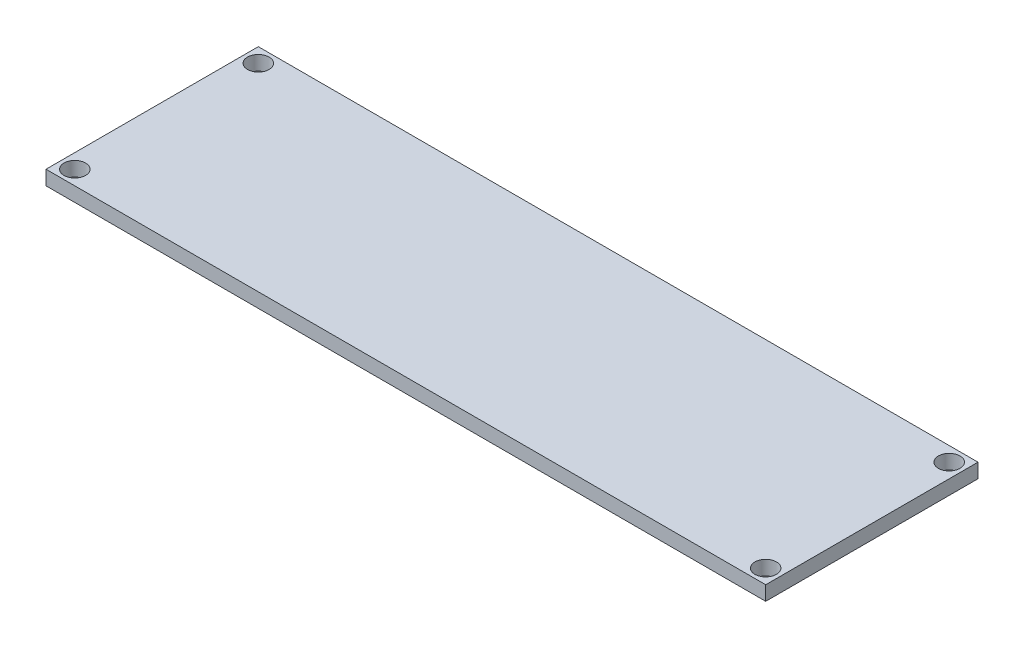
ISO-10303-21;
HEADER;
FILE_DESCRIPTION(('STEP AP214'),'2;1');
FILE_NAME('part.step','',(''),(''),'','','');
FILE_SCHEMA(('AUTOMOTIVE_DESIGN { 1 0 10303 214 1 1 1 1 }'));
ENDSEC;
DATA;
#1=APPLICATION_CONTEXT('core data for automotive mechanical design processes');
#2=APPLICATION_PROTOCOL_DEFINITION('international standard','automotive_design',2000,#1);
#3=PRODUCT_CONTEXT('',#1,'mechanical');
#4=PRODUCT('Part','Part','',(#3));
#5=PRODUCT_RELATED_PRODUCT_CATEGORY('part','',(#4));
#6=PRODUCT_DEFINITION_FORMATION('','',#4);
#7=PRODUCT_DEFINITION_CONTEXT('part definition',#1,'design');
#8=PRODUCT_DEFINITION('design','',#6,#7);
#9=PRODUCT_DEFINITION_SHAPE('','',#8);
#10=(LENGTH_UNIT() NAMED_UNIT(*) SI_UNIT(.MILLI.,.METRE.));
#11=(NAMED_UNIT(*) PLANE_ANGLE_UNIT() SI_UNIT($,.RADIAN.));
#12=(NAMED_UNIT(*) SI_UNIT($,.STERADIAN.) SOLID_ANGLE_UNIT());
#13=UNCERTAINTY_MEASURE_WITH_UNIT(LENGTH_MEASURE(1.E-05),#10,'distance_accuracy_value','');
#14=(GEOMETRIC_REPRESENTATION_CONTEXT(3) GLOBAL_UNCERTAINTY_ASSIGNED_CONTEXT((#13)) GLOBAL_UNIT_ASSIGNED_CONTEXT((#10,
#11,#12)) REPRESENTATION_CONTEXT('',''));
#15=CARTESIAN_POINT('',(0.,0.,0.));
#16=DIRECTION('',(0.,0.,1.));
#17=DIRECTION('',(1.,0.,0.));
#18=AXIS2_PLACEMENT_3D('',#15,#16,#17);
#19=CARTESIAN_POINT('',(-40.0266791281587,2.,-17.0192307692308));
#20=DIRECTION('',(1.,0.,0.));
#21=DIRECTION('',(0.,0.,-1.));
#22=AXIS2_PLACEMENT_3D('',#19,#20,#21);
#23=PLANE('',#22);
#24=DIRECTION('',(0.,0.,1.));
#25=VECTOR('',#24,1.);
#26=CARTESIAN_POINT('',(-40.0266791281587,0.,-17.0192307692308));
#27=LINE('',#26,#25);
#28=CARTESIAN_POINT('',(-40.0266791281587,0.,-17.0192307692308));
#29=VERTEX_POINT('',#28);
#30=CARTESIAN_POINT('',(-40.0266791281587,0.,12.4807692307692));
#31=VERTEX_POINT('',#30);
#32=EDGE_CURVE('E96',#29,#31,#27,.T.);
#33=ORIENTED_EDGE('',*,*,#32,.T.);
#34=DIRECTION('',(0.,-1.,0.));
#35=VECTOR('',#34,1.);
#36=CARTESIAN_POINT('',(-40.0266791281587,2.,12.4807692307692));
#37=LINE('',#36,#35);
#38=CARTESIAN_POINT('',(-40.0266791281587,2.,12.4807692307692));
#39=VERTEX_POINT('',#38);
#40=EDGE_CURVE('E11',#39,#31,#37,.T.);
#41=ORIENTED_EDGE('',*,*,#40,.F.);
#42=DIRECTION('',(0.,0.,1.));
#43=VECTOR('',#42,1.);
#44=CARTESIAN_POINT('',(-40.0266791281587,2.,-17.0192307692308));
#45=LINE('',#44,#43);
#46=CARTESIAN_POINT('',(-40.0266791281587,2.,-17.0192307692308));
#47=VERTEX_POINT('',#46);
#48=EDGE_CURVE('E84',#47,#39,#45,.T.);
#49=ORIENTED_EDGE('',*,*,#48,.F.);
#50=DIRECTION('',(0.,-1.,0.));
#51=VECTOR('',#50,1.);
#52=CARTESIAN_POINT('',(-40.0266791281587,2.,-17.0192307692308));
#53=LINE('',#52,#51);
#54=EDGE_CURVE('E92',#47,#29,#53,.T.);
#55=ORIENTED_EDGE('',*,*,#54,.T.);
#56=EDGE_LOOP('',(#33,#41,#49,#55));
#57=FACE_BOUND('',#56,.T.);
#58=ADVANCED_FACE('F33',(#57),#23,.F.);
#59=CARTESIAN_POINT('',(-40.0266791281587,2.,12.4807692307692));
#60=DIRECTION('',(0.,0.,-1.));
#61=DIRECTION('',(-1.,0.,0.));
#62=AXIS2_PLACEMENT_3D('',#59,#60,#61);
#63=PLANE('',#62);
#64=DIRECTION('',(1.,0.,0.));
#65=VECTOR('',#64,1.);
#66=CARTESIAN_POINT('',(-40.0266791281587,0.,12.4807692307692));
#67=LINE('',#66,#65);
#68=CARTESIAN_POINT('',(59.9733208718413,0.,12.4807692307692));
#69=VERTEX_POINT('',#68);
#70=EDGE_CURVE('E88',#31,#69,#67,.T.);
#71=ORIENTED_EDGE('',*,*,#70,.T.);
#72=DIRECTION('',(0.,-1.,0.));
#73=VECTOR('',#72,1.);
#74=CARTESIAN_POINT('',(59.9733208718413,2.,12.4807692307692));
#75=LINE('',#74,#73);
#76=CARTESIAN_POINT('',(59.9733208718413,2.,12.4807692307692));
#77=VERTEX_POINT('',#76);
#78=EDGE_CURVE('E41',#77,#69,#75,.T.);
#79=ORIENTED_EDGE('',*,*,#78,.F.);
#80=DIRECTION('',(1.,0.,0.));
#81=VECTOR('',#80,1.);
#82=CARTESIAN_POINT('',(-40.0266791281587,2.,12.4807692307692));
#83=LINE('',#82,#81);
#84=EDGE_CURVE('E79',#39,#77,#83,.T.);
#85=ORIENTED_EDGE('',*,*,#84,.F.);
#86=ORIENTED_EDGE('',*,*,#40,.T.);
#87=EDGE_LOOP('',(#71,#79,#85,#86));
#88=FACE_BOUND('',#87,.T.);
#89=ADVANCED_FACE('F87',(#88),#63,.F.);
#90=CARTESIAN_POINT('',(59.9733208718413,2.,-17.0192307692308));
#91=DIRECTION('',(-1.,0.,0.));
#92=DIRECTION('',(0.,0.,1.));
#93=AXIS2_PLACEMENT_3D('',#90,#91,#92);
#94=PLANE('',#93);
#95=DIRECTION('',(0.,0.,-1.));
#96=VECTOR('',#95,1.);
#97=CARTESIAN_POINT('',(59.9733208718413,0.,-17.0192307692308));
#98=LINE('',#97,#96);
#99=CARTESIAN_POINT('',(59.9733208718413,0.,-17.0192307692308));
#100=VERTEX_POINT('',#99);
#101=EDGE_CURVE('E66',#69,#100,#98,.T.);
#102=ORIENTED_EDGE('',*,*,#101,.T.);
#103=DIRECTION('',(0.,-1.,0.));
#104=VECTOR('',#103,1.);
#105=CARTESIAN_POINT('',(59.9733208718413,2.,-17.0192307692308));
#106=LINE('',#105,#104);
#107=CARTESIAN_POINT('',(59.9733208718413,2.,-17.0192307692308));
#108=VERTEX_POINT('',#107);
#109=EDGE_CURVE('E89',#108,#100,#106,.T.);
#110=ORIENTED_EDGE('',*,*,#109,.F.);
#111=DIRECTION('',(0.,0.,-1.));
#112=VECTOR('',#111,1.);
#113=CARTESIAN_POINT('',(59.9733208718413,2.,-17.0192307692308));
#114=LINE('',#113,#112);
#115=EDGE_CURVE('E82',#77,#108,#114,.T.);
#116=ORIENTED_EDGE('',*,*,#115,.F.);
#117=ORIENTED_EDGE('',*,*,#78,.T.);
#118=EDGE_LOOP('',(#102,#110,#116,#117));
#119=FACE_BOUND('',#118,.T.);
#120=ADVANCED_FACE('F90',(#119),#94,.F.);
#121=CARTESIAN_POINT('',(-40.0266791281587,2.,-17.0192307692308));
#122=DIRECTION('',(0.,0.,1.));
#123=DIRECTION('',(1.,0.,0.));
#124=AXIS2_PLACEMENT_3D('',#121,#122,#123);
#125=PLANE('',#124);
#126=DIRECTION('',(-1.,0.,0.));
#127=VECTOR('',#126,1.);
#128=CARTESIAN_POINT('',(-40.0266791281587,0.,-17.0192307692308));
#129=LINE('',#128,#127);
#130=EDGE_CURVE('E72',#100,#29,#129,.T.);
#131=ORIENTED_EDGE('',*,*,#130,.T.);
#132=ORIENTED_EDGE('',*,*,#54,.F.);
#133=DIRECTION('',(-1.,0.,0.));
#134=VECTOR('',#133,1.);
#135=CARTESIAN_POINT('',(-40.0266791281587,2.,-17.0192307692308));
#136=LINE('',#135,#134);
#137=EDGE_CURVE('E49',#108,#47,#136,.T.);
#138=ORIENTED_EDGE('',*,*,#137,.F.);
#139=ORIENTED_EDGE('',*,*,#109,.T.);
#140=EDGE_LOOP('',(#131,#132,#138,#139));
#141=FACE_BOUND('',#140,.T.);
#142=ADVANCED_FACE('F104',(#141),#125,.F.);
#143=CARTESIAN_POINT('',(0.,2.,0.));
#144=DIRECTION('',(0.,1.,0.));
#145=DIRECTION('',(0.,0.,1.));
#146=AXIS2_PLACEMENT_3D('',#143,#144,#145);
#147=PLANE('',#146);
#148=CARTESIAN_POINT('',(57.9733208718413,2.,-15.0192307692308));
#149=DIRECTION('',(0.,1.,0.));
#150=DIRECTION('',(0.,0.,1.));
#151=AXIS2_PLACEMENT_3D('',#148,#149,#150);
#152=CIRCLE('',#151,1.5);
#153=CARTESIAN_POINT('',(57.9733208718413,2.,-13.5192307692308));
#154=VERTEX_POINT('',#153);
#155=EDGE_CURVE('E120',#154,#154,#152,.T.);
#156=ORIENTED_EDGE('',*,*,#155,.F.);
#157=EDGE_LOOP('',(#156));
#158=FACE_BOUND('',#157,.T.);
#159=CARTESIAN_POINT('',(-38.0266791281587,2.,-15.0192307692308));
#160=DIRECTION('',(0.,1.,0.));
#161=DIRECTION('',(0.,0.,1.));
#162=AXIS2_PLACEMENT_3D('',#159,#160,#161);
#163=CIRCLE('',#162,1.5);
#164=CARTESIAN_POINT('',(-38.0266791281587,2.,-13.5192307692308));
#165=VERTEX_POINT('',#164);
#166=EDGE_CURVE('E119',#165,#165,#163,.T.);
#167=ORIENTED_EDGE('',*,*,#166,.F.);
#168=EDGE_LOOP('',(#167));
#169=FACE_BOUND('',#168,.T.);
#170=CARTESIAN_POINT('',(-38.0266791281587,2.,10.4807692307692));
#171=DIRECTION('',(0.,1.,0.));
#172=DIRECTION('',(0.,0.,1.));
#173=AXIS2_PLACEMENT_3D('',#170,#171,#172);
#174=CIRCLE('',#173,1.5);
#175=CARTESIAN_POINT('',(-38.0266791281587,2.,11.9807692307692));
#176=VERTEX_POINT('',#175);
#177=EDGE_CURVE('E126',#176,#176,#174,.T.);
#178=ORIENTED_EDGE('',*,*,#177,.F.);
#179=EDGE_LOOP('',(#178));
#180=FACE_BOUND('',#179,.T.);
#181=CARTESIAN_POINT('',(57.9733208718413,2.,10.4807692307692));
#182=DIRECTION('',(0.,1.,0.));
#183=DIRECTION('',(0.,0.,1.));
#184=AXIS2_PLACEMENT_3D('',#181,#182,#183);
#185=CIRCLE('',#184,1.5);
#186=CARTESIAN_POINT('',(57.9733208718413,2.,11.9807692307692));
#187=VERTEX_POINT('',#186);
#188=EDGE_CURVE('E112',#187,#187,#185,.T.);
#189=ORIENTED_EDGE('',*,*,#188,.F.);
#190=EDGE_LOOP('',(#189));
#191=FACE_BOUND('',#190,.T.);
#192=ORIENTED_EDGE('',*,*,#48,.T.);
#193=ORIENTED_EDGE('',*,*,#84,.T.);
#194=ORIENTED_EDGE('',*,*,#115,.T.);
#195=ORIENTED_EDGE('',*,*,#137,.T.);
#196=EDGE_LOOP('',(#192,#193,#194,#195));
#197=FACE_BOUND('',#196,.T.);
#198=ADVANCED_FACE('F80',(#158,#169,#180,#191,#197),#147,.T.);
#199=CARTESIAN_POINT('',(0.,0.,0.));
#200=DIRECTION('',(0.,1.,0.));
#201=DIRECTION('',(0.,0.,1.));
#202=AXIS2_PLACEMENT_3D('',#199,#200,#201);
#203=PLANE('',#202);
#204=CARTESIAN_POINT('',(57.9733208718413,0.,-15.0192307692308));
#205=DIRECTION('',(0.,1.,0.));
#206=DIRECTION('',(0.,0.,1.));
#207=AXIS2_PLACEMENT_3D('',#204,#205,#206);
#208=CIRCLE('',#207,1.5);
#209=CARTESIAN_POINT('',(57.9733208718413,0.,-13.5192307692308));
#210=VERTEX_POINT('',#209);
#211=EDGE_CURVE('E116',#210,#210,#208,.F.);
#212=ORIENTED_EDGE('',*,*,#211,.F.);
#213=EDGE_LOOP('',(#212));
#214=FACE_BOUND('',#213,.T.);
#215=CARTESIAN_POINT('',(-38.0266791281587,0.,-15.0192307692308));
#216=DIRECTION('',(0.,1.,0.));
#217=DIRECTION('',(0.,0.,1.));
#218=AXIS2_PLACEMENT_3D('',#215,#216,#217);
#219=CIRCLE('',#218,1.5);
#220=CARTESIAN_POINT('',(-38.0266791281587,0.,-13.5192307692308));
#221=VERTEX_POINT('',#220);
#222=EDGE_CURVE('E123',#221,#221,#219,.F.);
#223=ORIENTED_EDGE('',*,*,#222,.F.);
#224=EDGE_LOOP('',(#223));
#225=FACE_BOUND('',#224,.T.);
#226=CARTESIAN_POINT('',(-38.0266791281587,0.,10.4807692307692));
#227=DIRECTION('',(0.,1.,0.));
#228=DIRECTION('',(0.,0.,1.));
#229=AXIS2_PLACEMENT_3D('',#226,#227,#228);
#230=CIRCLE('',#229,1.5);
#231=CARTESIAN_POINT('',(-38.0266791281587,0.,11.9807692307692));
#232=VERTEX_POINT('',#231);
#233=EDGE_CURVE('E115',#232,#232,#230,.F.);
#234=ORIENTED_EDGE('',*,*,#233,.F.);
#235=EDGE_LOOP('',(#234));
#236=FACE_BOUND('',#235,.T.);
#237=CARTESIAN_POINT('',(57.9733208718413,0.,10.4807692307692));
#238=DIRECTION('',(0.,1.,0.));
#239=DIRECTION('',(0.,0.,1.));
#240=AXIS2_PLACEMENT_3D('',#237,#238,#239);
#241=CIRCLE('',#240,1.5);
#242=CARTESIAN_POINT('',(57.9733208718413,0.,11.9807692307692));
#243=VERTEX_POINT('',#242);
#244=EDGE_CURVE('E99',#243,#243,#241,.F.);
#245=ORIENTED_EDGE('',*,*,#244,.F.);
#246=EDGE_LOOP('',(#245));
#247=FACE_BOUND('',#246,.T.);
#248=ORIENTED_EDGE('',*,*,#32,.F.);
#249=ORIENTED_EDGE('',*,*,#130,.F.);
#250=ORIENTED_EDGE('',*,*,#101,.F.);
#251=ORIENTED_EDGE('',*,*,#70,.F.);
#252=EDGE_LOOP('',(#248,#249,#250,#251));
#253=FACE_BOUND('',#252,.T.);
#254=ADVANCED_FACE('F107',(#214,#225,#236,#247,#253),#203,.F.);
#255=CARTESIAN_POINT('',(57.9733208718413,-4.24264068711929,10.4807692307692));
#256=DIRECTION('',(0.,1.,0.));
#257=DIRECTION('',(0.,0.,1.));
#258=AXIS2_PLACEMENT_3D('',#255,#256,#257);
#259=CYLINDRICAL_SURFACE('',#258,1.5);
#260=ORIENTED_EDGE('',*,*,#244,.T.);
#261=EDGE_LOOP('',(#260));
#262=FACE_BOUND('',#261,.T.);
#263=ORIENTED_EDGE('',*,*,#188,.T.);
#264=EDGE_LOOP('',(#263));
#265=FACE_BOUND('',#264,.T.);
#266=ADVANCED_FACE('F142',(#262,#265),#259,.F.);
#267=CARTESIAN_POINT('',(-38.0266791281587,-4.24264068711929,10.4807692307692));
#268=DIRECTION('',(0.,1.,0.));
#269=DIRECTION('',(0.,0.,1.));
#270=AXIS2_PLACEMENT_3D('',#267,#268,#269);
#271=CYLINDRICAL_SURFACE('',#270,1.5);
#272=ORIENTED_EDGE('',*,*,#233,.T.);
#273=EDGE_LOOP('',(#272));
#274=FACE_BOUND('',#273,.T.);
#275=ORIENTED_EDGE('',*,*,#177,.T.);
#276=EDGE_LOOP('',(#275));
#277=FACE_BOUND('',#276,.T.);
#278=ADVANCED_FACE('F134',(#274,#277),#271,.F.);
#279=CARTESIAN_POINT('',(-38.0266791281587,-4.24264068711929,-15.0192307692308));
#280=DIRECTION('',(0.,1.,0.));
#281=DIRECTION('',(0.,0.,1.));
#282=AXIS2_PLACEMENT_3D('',#279,#280,#281);
#283=CYLINDRICAL_SURFACE('',#282,1.5);
#284=ORIENTED_EDGE('',*,*,#222,.T.);
#285=EDGE_LOOP('',(#284));
#286=FACE_BOUND('',#285,.T.);
#287=ORIENTED_EDGE('',*,*,#166,.T.);
#288=EDGE_LOOP('',(#287));
#289=FACE_BOUND('',#288,.T.);
#290=ADVANCED_FACE('F150',(#286,#289),#283,.F.);
#291=CARTESIAN_POINT('',(57.9733208718413,-4.24264068711929,-15.0192307692308));
#292=DIRECTION('',(0.,1.,0.));
#293=DIRECTION('',(0.,0.,1.));
#294=AXIS2_PLACEMENT_3D('',#291,#292,#293);
#295=CYLINDRICAL_SURFACE('',#294,1.5);
#296=ORIENTED_EDGE('',*,*,#211,.T.);
#297=EDGE_LOOP('',(#296));
#298=FACE_BOUND('',#297,.T.);
#299=ORIENTED_EDGE('',*,*,#155,.T.);
#300=EDGE_LOOP('',(#299));
#301=FACE_BOUND('',#300,.T.);
#302=ADVANCED_FACE('F199',(#298,#301),#295,.F.);
#303=CLOSED_SHELL('',(#58,#89,#120,#142,#198,#254,#266,#278,#290,#302));
#304=MANIFOLD_SOLID_BREP('B2',#303);
#305=ADVANCED_BREP_SHAPE_REPRESENTATION('',(#18,#304),#14);
#306=SHAPE_DEFINITION_REPRESENTATION(#9,#305);
ENDSEC;
END-ISO-10303-21;
